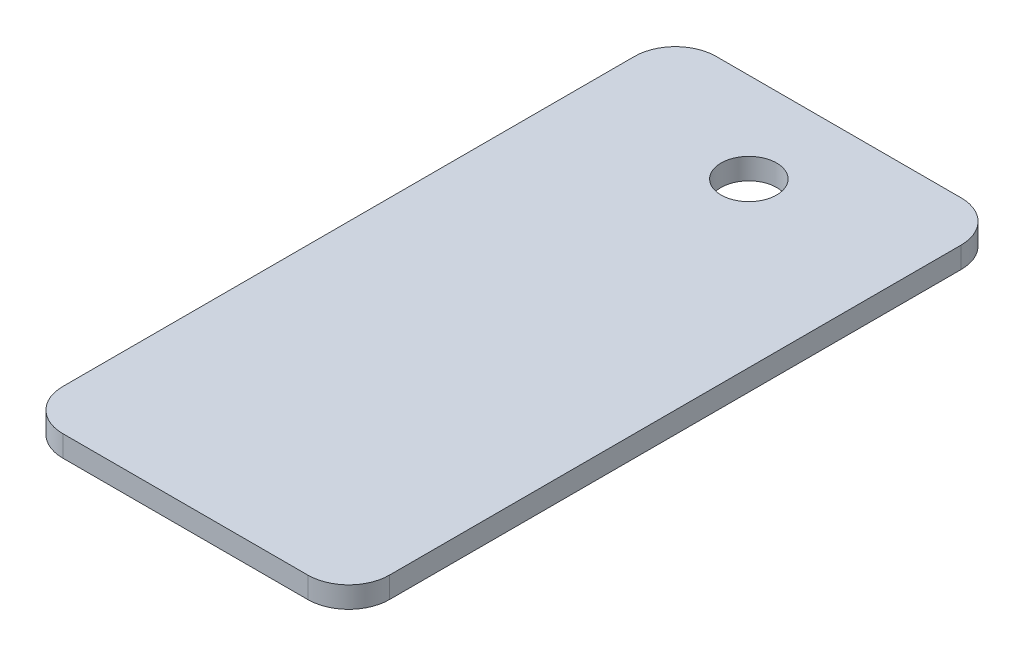
ISO-10303-21;
HEADER;
FILE_DESCRIPTION(('STEP AP214'),'2;1');
FILE_NAME('part.step','',(''),(''),'','','');
FILE_SCHEMA(('AUTOMOTIVE_DESIGN { 1 0 10303 214 1 1 1 1 }'));
ENDSEC;
DATA;
#1=APPLICATION_CONTEXT('core data for automotive mechanical design processes');
#2=APPLICATION_PROTOCOL_DEFINITION('international standard','automotive_design',2000,#1);
#3=PRODUCT_CONTEXT('',#1,'mechanical');
#4=PRODUCT('Part','Part','',(#3));
#5=PRODUCT_RELATED_PRODUCT_CATEGORY('part','',(#4));
#6=PRODUCT_DEFINITION_FORMATION('','',#4);
#7=PRODUCT_DEFINITION_CONTEXT('part definition',#1,'design');
#8=PRODUCT_DEFINITION('design','',#6,#7);
#9=PRODUCT_DEFINITION_SHAPE('','',#8);
#10=(LENGTH_UNIT() NAMED_UNIT(*) SI_UNIT(.MILLI.,.METRE.));
#11=(NAMED_UNIT(*) PLANE_ANGLE_UNIT() SI_UNIT($,.RADIAN.));
#12=(NAMED_UNIT(*) SI_UNIT($,.STERADIAN.) SOLID_ANGLE_UNIT());
#13=UNCERTAINTY_MEASURE_WITH_UNIT(LENGTH_MEASURE(1.E-05),#10,'distance_accuracy_value','');
#14=(GEOMETRIC_REPRESENTATION_CONTEXT(3) GLOBAL_UNCERTAINTY_ASSIGNED_CONTEXT((#13)) GLOBAL_UNIT_ASSIGNED_CONTEXT((#10,
#11,#12)) REPRESENTATION_CONTEXT('',''));
#15=CARTESIAN_POINT('',(0.,0.,0.));
#16=DIRECTION('',(0.,0.,1.));
#17=DIRECTION('',(1.,0.,0.));
#18=AXIS2_PLACEMENT_3D('',#15,#16,#17);
#19=CARTESIAN_POINT('',(0.,1.3,0.));
#20=DIRECTION('',(1.,0.,0.));
#21=DIRECTION('',(0.,0.,-1.));
#22=AXIS2_PLACEMENT_3D('',#19,#20,#21);
#23=PLANE('',#22);
#24=DIRECTION('',(0.,0.,1.));
#25=VECTOR('',#24,1.);
#26=CARTESIAN_POINT('',(0.,0.,0.));
#27=LINE('',#26,#25);
#28=CARTESIAN_POINT('',(0.,0.,2.5));
#29=VERTEX_POINT('',#28);
#30=CARTESIAN_POINT('',(0.,0.,37.5));
#31=VERTEX_POINT('',#30);
#32=EDGE_CURVE('E134',#29,#31,#27,.T.);
#33=ORIENTED_EDGE('',*,*,#32,.T.);
#34=DIRECTION('',(0.,-1.,0.));
#35=VECTOR('',#34,1.);
#36=CARTESIAN_POINT('',(0.,1.3,37.5));
#37=LINE('',#36,#35);
#38=CARTESIAN_POINT('',(0.,1.3,37.5));
#39=VERTEX_POINT('',#38);
#40=EDGE_CURVE('E157',#31,#39,#37,.F.);
#41=ORIENTED_EDGE('',*,*,#40,.T.);
#42=DIRECTION('',(0.,0.,1.));
#43=VECTOR('',#42,1.);
#44=CARTESIAN_POINT('',(0.,1.3,0.));
#45=LINE('',#44,#43);
#46=CARTESIAN_POINT('',(0.,1.3,2.5));
#47=VERTEX_POINT('',#46);
#48=EDGE_CURVE('E132',#47,#39,#45,.T.);
#49=ORIENTED_EDGE('',*,*,#48,.F.);
#50=DIRECTION('',(0.,-1.,0.));
#51=VECTOR('',#50,1.);
#52=CARTESIAN_POINT('',(0.,1.3,2.5));
#53=LINE('',#52,#51);
#54=EDGE_CURVE('E154',#47,#29,#53,.T.);
#55=ORIENTED_EDGE('',*,*,#54,.T.);
#56=EDGE_LOOP('',(#33,#41,#49,#55));
#57=FACE_BOUND('',#56,.T.);
#58=ADVANCED_FACE('F39',(#57),#23,.F.);
#59=CARTESIAN_POINT('',(0.,1.3,40.));
#60=DIRECTION('',(0.,0.,-1.));
#61=DIRECTION('',(-1.,0.,0.));
#62=AXIS2_PLACEMENT_3D('',#59,#60,#61);
#63=PLANE('',#62);
#64=DIRECTION('',(1.,0.,0.));
#65=VECTOR('',#64,1.);
#66=CARTESIAN_POINT('',(0.,0.,40.));
#67=LINE('',#66,#65);
#68=CARTESIAN_POINT('',(2.5,0.,40.));
#69=VERTEX_POINT('',#68);
#70=CARTESIAN_POINT('',(17.5,0.,40.));
#71=VERTEX_POINT('',#70);
#72=EDGE_CURVE('E130',#69,#71,#67,.T.);
#73=ORIENTED_EDGE('',*,*,#72,.T.);
#74=DIRECTION('',(0.,-1.,0.));
#75=VECTOR('',#74,1.);
#76=CARTESIAN_POINT('',(17.5,1.3,40.));
#77=LINE('',#76,#75);
#78=CARTESIAN_POINT('',(17.5,1.3,40.));
#79=VERTEX_POINT('',#78);
#80=EDGE_CURVE('E109',#71,#79,#77,.F.);
#81=ORIENTED_EDGE('',*,*,#80,.T.);
#82=DIRECTION('',(1.,0.,0.));
#83=VECTOR('',#82,1.);
#84=CARTESIAN_POINT('',(0.,1.3,40.));
#85=LINE('',#84,#83);
#86=CARTESIAN_POINT('',(2.5,1.3,40.));
#87=VERTEX_POINT('',#86);
#88=EDGE_CURVE('E173',#87,#79,#85,.T.);
#89=ORIENTED_EDGE('',*,*,#88,.F.);
#90=DIRECTION('',(0.,-1.,0.));
#91=VECTOR('',#90,1.);
#92=CARTESIAN_POINT('',(2.5,1.3,40.));
#93=LINE('',#92,#91);
#94=EDGE_CURVE('E114',#87,#69,#93,.T.);
#95=ORIENTED_EDGE('',*,*,#94,.T.);
#96=EDGE_LOOP('',(#73,#81,#89,#95));
#97=FACE_BOUND('',#96,.T.);
#98=ADVANCED_FACE('F197',(#97),#63,.F.);
#99=CARTESIAN_POINT('',(20.,1.3,0.));
#100=DIRECTION('',(-1.,0.,0.));
#101=DIRECTION('',(0.,0.,1.));
#102=AXIS2_PLACEMENT_3D('',#99,#100,#101);
#103=PLANE('',#102);
#104=DIRECTION('',(0.,0.,-1.));
#105=VECTOR('',#104,1.);
#106=CARTESIAN_POINT('',(20.,1.3,0.));
#107=LINE('',#106,#105);
#108=CARTESIAN_POINT('',(20.,1.3,37.5));
#109=VERTEX_POINT('',#108);
#110=CARTESIAN_POINT('',(20.,1.3,2.5));
#111=VERTEX_POINT('',#110);
#112=EDGE_CURVE('E123',#109,#111,#107,.T.);
#113=ORIENTED_EDGE('',*,*,#112,.F.);
#114=DIRECTION('',(0.,-1.,0.));
#115=VECTOR('',#114,1.);
#116=CARTESIAN_POINT('',(20.,1.3,37.5));
#117=LINE('',#116,#115);
#118=CARTESIAN_POINT('',(20.,0.,37.5));
#119=VERTEX_POINT('',#118);
#120=EDGE_CURVE('E108',#109,#119,#117,.T.);
#121=ORIENTED_EDGE('',*,*,#120,.T.);
#122=DIRECTION('',(0.,0.,-1.));
#123=VECTOR('',#122,1.);
#124=CARTESIAN_POINT('',(20.,0.,0.));
#125=LINE('',#124,#123);
#126=CARTESIAN_POINT('',(20.,0.,2.5));
#127=VERTEX_POINT('',#126);
#128=EDGE_CURVE('E121',#119,#127,#125,.T.);
#129=ORIENTED_EDGE('',*,*,#128,.T.);
#130=DIRECTION('',(0.,-1.,0.));
#131=VECTOR('',#130,1.);
#132=CARTESIAN_POINT('',(20.,1.3,2.5));
#133=LINE('',#132,#131);
#134=EDGE_CURVE('E125',#127,#111,#133,.F.);
#135=ORIENTED_EDGE('',*,*,#134,.T.);
#136=EDGE_LOOP('',(#113,#121,#129,#135));
#137=FACE_BOUND('',#136,.T.);
#138=ADVANCED_FACE('F120',(#137),#103,.F.);
#139=CARTESIAN_POINT('',(0.,1.3,0.));
#140=DIRECTION('',(0.,0.,1.));
#141=DIRECTION('',(1.,0.,0.));
#142=AXIS2_PLACEMENT_3D('',#139,#140,#141);
#143=PLANE('',#142);
#144=DIRECTION('',(-1.,0.,0.));
#145=VECTOR('',#144,1.);
#146=CARTESIAN_POINT('',(0.,0.,0.));
#147=LINE('',#146,#145);
#148=CARTESIAN_POINT('',(17.5,0.,0.));
#149=VERTEX_POINT('',#148);
#150=CARTESIAN_POINT('',(2.5,0.,0.));
#151=VERTEX_POINT('',#150);
#152=EDGE_CURVE('E129',#149,#151,#147,.T.);
#153=ORIENTED_EDGE('',*,*,#152,.T.);
#154=DIRECTION('',(0.,-1.,0.));
#155=VECTOR('',#154,1.);
#156=CARTESIAN_POINT('',(2.5,1.3,0.));
#157=LINE('',#156,#155);
#158=CARTESIAN_POINT('',(2.5,1.3,0.));
#159=VERTEX_POINT('',#158);
#160=EDGE_CURVE('E11',#151,#159,#157,.F.);
#161=ORIENTED_EDGE('',*,*,#160,.T.);
#162=DIRECTION('',(-1.,0.,0.));
#163=VECTOR('',#162,1.);
#164=CARTESIAN_POINT('',(0.,1.3,0.));
#165=LINE('',#164,#163);
#166=CARTESIAN_POINT('',(17.5,1.3,0.));
#167=VERTEX_POINT('',#166);
#168=EDGE_CURVE('E138',#167,#159,#165,.T.);
#169=ORIENTED_EDGE('',*,*,#168,.F.);
#170=DIRECTION('',(0.,-1.,0.));
#171=VECTOR('',#170,1.);
#172=CARTESIAN_POINT('',(17.5,1.3,0.));
#173=LINE('',#172,#171);
#174=EDGE_CURVE('E47',#167,#149,#173,.T.);
#175=ORIENTED_EDGE('',*,*,#174,.T.);
#176=EDGE_LOOP('',(#153,#161,#169,#175));
#177=FACE_BOUND('',#176,.T.);
#178=ADVANCED_FACE('F160',(#177),#143,.F.);
#179=CARTESIAN_POINT('',(0.,1.3,0.));
#180=DIRECTION('',(0.,1.,0.));
#181=DIRECTION('',(0.,0.,1.));
#182=AXIS2_PLACEMENT_3D('',#179,#180,#181);
#183=PLANE('',#182);
#184=CARTESIAN_POINT('',(10.,1.3,5.5));
#185=DIRECTION('',(0.,1.,0.));
#186=DIRECTION('',(0.,0.,1.));
#187=AXIS2_PLACEMENT_3D('',#184,#185,#186);
#188=CIRCLE('',#187,1.69999999999999);
#189=CARTESIAN_POINT('',(10.,1.3,7.19999999999999));
#190=VERTEX_POINT('',#189);
#191=EDGE_CURVE('E183',#190,#190,#188,.T.);
#192=ORIENTED_EDGE('',*,*,#191,.F.);
#193=EDGE_LOOP('',(#192));
#194=FACE_BOUND('',#193,.T.);
#195=ORIENTED_EDGE('',*,*,#88,.T.);
#196=CARTESIAN_POINT('',(17.5,1.3,37.5));
#197=DIRECTION('',(0.,1.,0.));
#198=DIRECTION('',(0.,0.,1.));
#199=AXIS2_PLACEMENT_3D('',#196,#197,#198);
#200=CIRCLE('',#199,2.5);
#201=EDGE_CURVE('E152',#79,#109,#200,.T.);
#202=ORIENTED_EDGE('',*,*,#201,.T.);
#203=ORIENTED_EDGE('',*,*,#112,.T.);
#204=CARTESIAN_POINT('',(17.5,1.3,2.5));
#205=DIRECTION('',(0.,1.,0.));
#206=DIRECTION('',(0.,0.,1.));
#207=AXIS2_PLACEMENT_3D('',#204,#205,#206);
#208=CIRCLE('',#207,2.5);
#209=EDGE_CURVE('E59',#111,#167,#208,.T.);
#210=ORIENTED_EDGE('',*,*,#209,.T.);
#211=ORIENTED_EDGE('',*,*,#168,.T.);
#212=CARTESIAN_POINT('',(2.5,1.3,2.5));
#213=DIRECTION('',(0.,1.,0.));
#214=DIRECTION('',(0.,0.,1.));
#215=AXIS2_PLACEMENT_3D('',#212,#213,#214);
#216=CIRCLE('',#215,2.5);
#217=EDGE_CURVE('E148',#159,#47,#216,.T.);
#218=ORIENTED_EDGE('',*,*,#217,.T.);
#219=ORIENTED_EDGE('',*,*,#48,.T.);
#220=CARTESIAN_POINT('',(2.5,1.3,37.5));
#221=DIRECTION('',(0.,1.,0.));
#222=DIRECTION('',(0.,0.,1.));
#223=AXIS2_PLACEMENT_3D('',#220,#221,#222);
#224=CIRCLE('',#223,2.5);
#225=EDGE_CURVE('E150',#39,#87,#224,.T.);
#226=ORIENTED_EDGE('',*,*,#225,.T.);
#227=EDGE_LOOP('',(#195,#202,#203,#210,#211,#218,#219,#226));
#228=FACE_BOUND('',#227,.T.);
#229=ADVANCED_FACE('F191',(#194,#228),#183,.T.);
#230=CARTESIAN_POINT('',(0.,0.,0.));
#231=DIRECTION('',(0.,1.,0.));
#232=DIRECTION('',(0.,0.,1.));
#233=AXIS2_PLACEMENT_3D('',#230,#231,#232);
#234=PLANE('',#233);
#235=CARTESIAN_POINT('',(10.,0.,5.5));
#236=DIRECTION('',(0.,1.,0.));
#237=DIRECTION('',(0.,0.,1.));
#238=AXIS2_PLACEMENT_3D('',#235,#236,#237);
#239=CIRCLE('',#238,1.69999999999999);
#240=CARTESIAN_POINT('',(10.,0.,7.2));
#241=VERTEX_POINT('',#240);
#242=EDGE_CURVE('E178',#241,#241,#239,.T.);
#243=ORIENTED_EDGE('',*,*,#242,.T.);
#244=EDGE_LOOP('',(#243));
#245=FACE_BOUND('',#244,.T.);
#246=ORIENTED_EDGE('',*,*,#128,.F.);
#247=CARTESIAN_POINT('',(17.5,0.,37.5));
#248=DIRECTION('',(0.,1.,0.));
#249=DIRECTION('',(0.,0.,1.));
#250=AXIS2_PLACEMENT_3D('',#247,#248,#249);
#251=CIRCLE('',#250,2.5);
#252=EDGE_CURVE('E104',#119,#71,#251,.F.);
#253=ORIENTED_EDGE('',*,*,#252,.T.);
#254=ORIENTED_EDGE('',*,*,#72,.F.);
#255=CARTESIAN_POINT('',(2.5,0.,37.5));
#256=DIRECTION('',(0.,1.,0.));
#257=DIRECTION('',(0.,0.,1.));
#258=AXIS2_PLACEMENT_3D('',#255,#256,#257);
#259=CIRCLE('',#258,2.5);
#260=EDGE_CURVE('E115',#69,#31,#259,.F.);
#261=ORIENTED_EDGE('',*,*,#260,.T.);
#262=ORIENTED_EDGE('',*,*,#32,.F.);
#263=CARTESIAN_POINT('',(2.5,0.,2.5));
#264=DIRECTION('',(0.,1.,0.));
#265=DIRECTION('',(0.,0.,1.));
#266=AXIS2_PLACEMENT_3D('',#263,#264,#265);
#267=CIRCLE('',#266,2.5);
#268=EDGE_CURVE('E141',#29,#151,#267,.F.);
#269=ORIENTED_EDGE('',*,*,#268,.T.);
#270=ORIENTED_EDGE('',*,*,#152,.F.);
#271=CARTESIAN_POINT('',(17.5,0.,2.5));
#272=DIRECTION('',(0.,1.,0.));
#273=DIRECTION('',(0.,0.,1.));
#274=AXIS2_PLACEMENT_3D('',#271,#272,#273);
#275=CIRCLE('',#274,2.5);
#276=EDGE_CURVE('E124',#149,#127,#275,.F.);
#277=ORIENTED_EDGE('',*,*,#276,.T.);
#278=EDGE_LOOP('',(#246,#253,#254,#261,#262,#269,#270,#277));
#279=FACE_BOUND('',#278,.T.);
#280=ADVANCED_FACE('F127',(#245,#279),#234,.F.);
#281=CARTESIAN_POINT('',(10.,1.3,5.5));
#282=DIRECTION('',(0.,1.,0.));
#283=DIRECTION('',(0.,0.,1.));
#284=AXIS2_PLACEMENT_3D('',#281,#282,#283);
#285=CYLINDRICAL_SURFACE('',#284,1.69999999999999);
#286=ORIENTED_EDGE('',*,*,#242,.F.);
#287=EDGE_LOOP('',(#286));
#288=FACE_BOUND('',#287,.T.);
#289=ORIENTED_EDGE('',*,*,#191,.T.);
#290=EDGE_LOOP('',(#289));
#291=FACE_BOUND('',#290,.T.);
#292=ADVANCED_FACE('F189',(#288,#291),#285,.F.);
#293=CARTESIAN_POINT('',(17.5,1.3,37.5));
#294=DIRECTION('',(0.,-1.,0.));
#295=DIRECTION('',(0.,0.,-1.));
#296=AXIS2_PLACEMENT_3D('',#293,#294,#295);
#297=CYLINDRICAL_SURFACE('',#296,2.5);
#298=ORIENTED_EDGE('',*,*,#201,.F.);
#299=ORIENTED_EDGE('',*,*,#80,.F.);
#300=ORIENTED_EDGE('',*,*,#252,.F.);
#301=ORIENTED_EDGE('',*,*,#120,.F.);
#302=EDGE_LOOP('',(#298,#299,#300,#301));
#303=FACE_BOUND('',#302,.T.);
#304=ADVANCED_FACE('F107',(#303),#297,.T.);
#305=CARTESIAN_POINT('',(2.5,1.3,37.5));
#306=DIRECTION('',(0.,-1.,0.));
#307=DIRECTION('',(0.,0.,-1.));
#308=AXIS2_PLACEMENT_3D('',#305,#306,#307);
#309=CYLINDRICAL_SURFACE('',#308,2.5);
#310=ORIENTED_EDGE('',*,*,#225,.F.);
#311=ORIENTED_EDGE('',*,*,#40,.F.);
#312=ORIENTED_EDGE('',*,*,#260,.F.);
#313=ORIENTED_EDGE('',*,*,#94,.F.);
#314=EDGE_LOOP('',(#310,#311,#312,#313));
#315=FACE_BOUND('',#314,.T.);
#316=ADVANCED_FACE('F199',(#315),#309,.T.);
#317=CARTESIAN_POINT('',(2.5,1.3,2.5));
#318=DIRECTION('',(0.,-1.,0.));
#319=DIRECTION('',(0.,0.,-1.));
#320=AXIS2_PLACEMENT_3D('',#317,#318,#319);
#321=CYLINDRICAL_SURFACE('',#320,2.5);
#322=ORIENTED_EDGE('',*,*,#217,.F.);
#323=ORIENTED_EDGE('',*,*,#160,.F.);
#324=ORIENTED_EDGE('',*,*,#268,.F.);
#325=ORIENTED_EDGE('',*,*,#54,.F.);
#326=EDGE_LOOP('',(#322,#323,#324,#325));
#327=FACE_BOUND('',#326,.T.);
#328=ADVANCED_FACE('F167',(#327),#321,.T.);
#329=CARTESIAN_POINT('',(17.5,1.3,2.5));
#330=DIRECTION('',(0.,-1.,0.));
#331=DIRECTION('',(0.,0.,-1.));
#332=AXIS2_PLACEMENT_3D('',#329,#330,#331);
#333=CYLINDRICAL_SURFACE('',#332,2.5);
#334=ORIENTED_EDGE('',*,*,#209,.F.);
#335=ORIENTED_EDGE('',*,*,#134,.F.);
#336=ORIENTED_EDGE('',*,*,#276,.F.);
#337=ORIENTED_EDGE('',*,*,#174,.F.);
#338=EDGE_LOOP('',(#334,#335,#336,#337));
#339=FACE_BOUND('',#338,.T.);
#340=ADVANCED_FACE('F41',(#339),#333,.T.);
#341=CLOSED_SHELL('',(#58,#98,#138,#178,#229,#280,#292,#304,#316,#328,#340));
#342=MANIFOLD_SOLID_BREP('B2',#341);
#343=ADVANCED_BREP_SHAPE_REPRESENTATION('',(#18,#342),#14);
#344=SHAPE_DEFINITION_REPRESENTATION(#9,#343);
ENDSEC;
END-ISO-10303-21;
